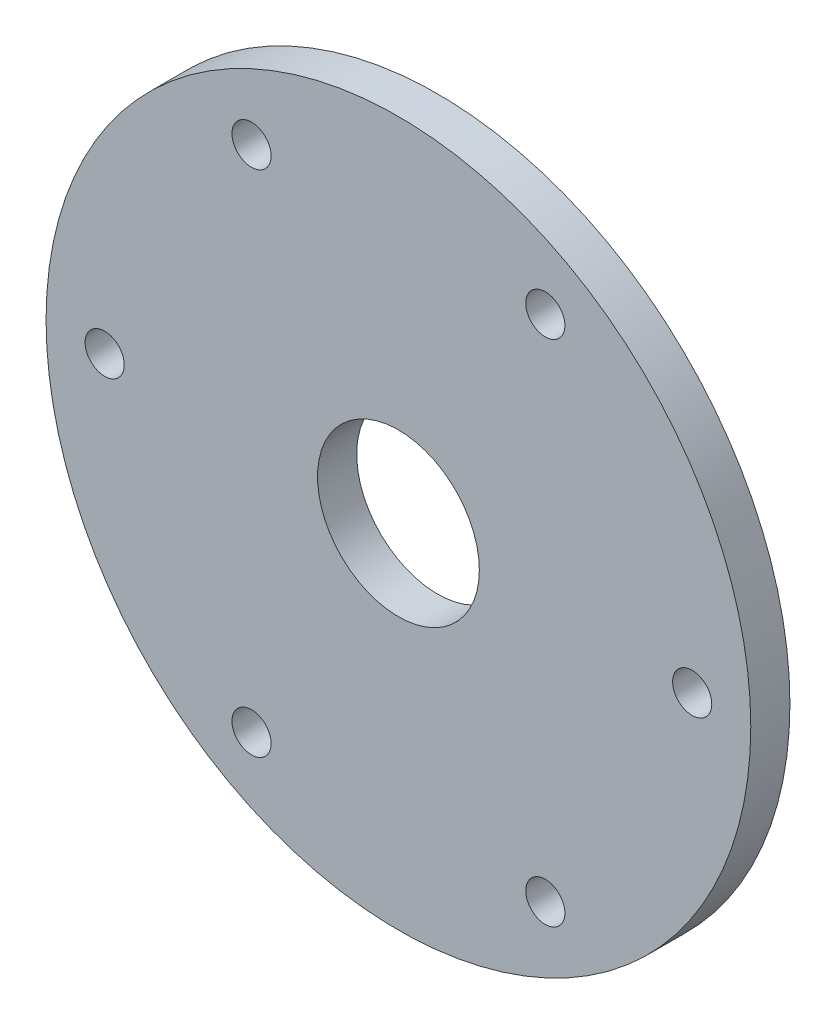
ISO-10303-21;
HEADER;
FILE_DESCRIPTION(('STEP AP214'),'2;1');
FILE_NAME('part.step','',(''),(''),'','','');
FILE_SCHEMA(('AUTOMOTIVE_DESIGN { 1 0 10303 214 1 1 1 1 }'));
ENDSEC;
DATA;
#1=APPLICATION_CONTEXT('core data for automotive mechanical design processes');
#2=APPLICATION_PROTOCOL_DEFINITION('international standard','automotive_design',2000,#1);
#3=PRODUCT_CONTEXT('',#1,'mechanical');
#4=PRODUCT('Part','Part','',(#3));
#5=PRODUCT_RELATED_PRODUCT_CATEGORY('part','',(#4));
#6=PRODUCT_DEFINITION_FORMATION('','',#4);
#7=PRODUCT_DEFINITION_CONTEXT('part definition',#1,'design');
#8=PRODUCT_DEFINITION('design','',#6,#7);
#9=PRODUCT_DEFINITION_SHAPE('','',#8);
#10=(LENGTH_UNIT() NAMED_UNIT(*) SI_UNIT(.MILLI.,.METRE.));
#11=(NAMED_UNIT(*) PLANE_ANGLE_UNIT() SI_UNIT($,.RADIAN.));
#12=(NAMED_UNIT(*) SI_UNIT($,.STERADIAN.) SOLID_ANGLE_UNIT());
#13=UNCERTAINTY_MEASURE_WITH_UNIT(LENGTH_MEASURE(1.E-05),#10,'distance_accuracy_value','');
#14=(GEOMETRIC_REPRESENTATION_CONTEXT(3) GLOBAL_UNCERTAINTY_ASSIGNED_CONTEXT((#13)) GLOBAL_UNIT_ASSIGNED_CONTEXT((#10,
#11,#12)) REPRESENTATION_CONTEXT('',''));
#15=CARTESIAN_POINT('',(0.,0.,0.));
#16=DIRECTION('',(0.,0.,1.));
#17=DIRECTION('',(1.,0.,0.));
#18=AXIS2_PLACEMENT_3D('',#15,#16,#17);
#19=CARTESIAN_POINT('',(0.,0.,3.));
#20=DIRECTION('',(0.,0.,1.));
#21=DIRECTION('',(1.,0.,0.));
#22=AXIS2_PLACEMENT_3D('',#19,#20,#21);
#23=PLANE('',#22);
#24=CARTESIAN_POINT('',(-11.2549999999998,19.4942318391878,3.));
#25=DIRECTION('',(0.,0.,1.));
#26=DIRECTION('',(1.,0.,0.));
#27=AXIS2_PLACEMENT_3D('',#24,#25,#26);
#28=CIRCLE('',#27,1.5);
#29=CARTESIAN_POINT('',(-9.75499999999982,19.4942318391878,3.));
#30=VERTEX_POINT('',#29);
#31=EDGE_CURVE('E92',#30,#30,#28,.T.);
#32=ORIENTED_EDGE('',*,*,#31,.F.);
#33=EDGE_LOOP('',(#32));
#34=FACE_BOUND('',#33,.T.);
#35=CARTESIAN_POINT('',(-11.2550000000001,-19.4942318391877,3.));
#36=DIRECTION('',(0.,0.,1.));
#37=DIRECTION('',(1.,0.,0.));
#38=AXIS2_PLACEMENT_3D('',#35,#36,#37);
#39=CIRCLE('',#38,1.5);
#40=CARTESIAN_POINT('',(-9.75500000000009,-19.4942318391877,3.));
#41=VERTEX_POINT('',#40);
#42=EDGE_CURVE('E76',#41,#41,#39,.T.);
#43=ORIENTED_EDGE('',*,*,#42,.F.);
#44=EDGE_LOOP('',(#43));
#45=FACE_BOUND('',#44,.T.);
#46=CARTESIAN_POINT('',(22.51,0.,3.));
#47=DIRECTION('',(0.,0.,1.));
#48=DIRECTION('',(1.,0.,0.));
#49=AXIS2_PLACEMENT_3D('',#46,#47,#48);
#50=CIRCLE('',#49,1.5);
#51=CARTESIAN_POINT('',(24.01,0.,3.));
#52=VERTEX_POINT('',#51);
#53=EDGE_CURVE('E60',#52,#52,#50,.T.);
#54=ORIENTED_EDGE('',*,*,#53,.F.);
#55=EDGE_LOOP('',(#54));
#56=FACE_BOUND('',#55,.T.);
#57=CARTESIAN_POINT('',(0.,0.,3.));
#58=DIRECTION('',(0.,0.,1.));
#59=DIRECTION('',(1.,0.,0.));
#60=AXIS2_PLACEMENT_3D('',#57,#58,#59);
#61=CIRCLE('',#60,27.);
#62=CARTESIAN_POINT('',(27.,0.,3.));
#63=VERTEX_POINT('',#62);
#64=EDGE_CURVE('E10',#63,#63,#61,.T.);
#65=ORIENTED_EDGE('',*,*,#64,.T.);
#66=EDGE_LOOP('',(#65));
#67=FACE_BOUND('',#66,.T.);
#68=CARTESIAN_POINT('',(0.,0.,3.));
#69=DIRECTION('',(0.,0.,1.));
#70=DIRECTION('',(1.,0.,0.));
#71=AXIS2_PLACEMENT_3D('',#68,#69,#70);
#72=CIRCLE('',#71,6.2);
#73=CARTESIAN_POINT('',(6.2,0.,3.));
#74=VERTEX_POINT('',#73);
#75=EDGE_CURVE('E54',#74,#74,#72,.T.);
#76=ORIENTED_EDGE('',*,*,#75,.F.);
#77=EDGE_LOOP('',(#76));
#78=FACE_BOUND('',#77,.T.);
#79=CARTESIAN_POINT('',(11.255,-19.4942318391877,3.));
#80=DIRECTION('',(0.,0.,1.));
#81=DIRECTION('',(1.,0.,0.));
#82=AXIS2_PLACEMENT_3D('',#79,#80,#81);
#83=CIRCLE('',#82,1.5);
#84=CARTESIAN_POINT('',(12.755,-19.4942318391877,3.));
#85=VERTEX_POINT('',#84);
#86=EDGE_CURVE('E68',#85,#85,#83,.T.);
#87=ORIENTED_EDGE('',*,*,#86,.F.);
#88=EDGE_LOOP('',(#87));
#89=FACE_BOUND('',#88,.T.);
#90=CARTESIAN_POINT('',(-22.51,1.57186489874718E-13,3.));
#91=DIRECTION('',(0.,0.,1.));
#92=DIRECTION('',(1.,0.,0.));
#93=AXIS2_PLACEMENT_3D('',#90,#91,#92);
#94=CIRCLE('',#93,1.5);
#95=CARTESIAN_POINT('',(-21.01,1.57186489874718E-13,3.));
#96=VERTEX_POINT('',#95);
#97=EDGE_CURVE('E84',#96,#96,#94,.T.);
#98=ORIENTED_EDGE('',*,*,#97,.F.);
#99=EDGE_LOOP('',(#98));
#100=FACE_BOUND('',#99,.T.);
#101=CARTESIAN_POINT('',(11.2550000000002,19.4942318391876,3.));
#102=DIRECTION('',(0.,0.,1.));
#103=DIRECTION('',(1.,0.,0.));
#104=AXIS2_PLACEMENT_3D('',#101,#102,#103);
#105=CIRCLE('',#104,1.5);
#106=CARTESIAN_POINT('',(12.7550000000002,19.4942318391876,3.));
#107=VERTEX_POINT('',#106);
#108=EDGE_CURVE('E100',#107,#107,#105,.T.);
#109=ORIENTED_EDGE('',*,*,#108,.F.);
#110=EDGE_LOOP('',(#109));
#111=FACE_BOUND('',#110,.T.);
#112=ADVANCED_FACE('F41',(#34,#45,#56,#67,#78,#89,#100,#111),#23,.T.);
#113=CARTESIAN_POINT('',(0.,0.,0.));
#114=DIRECTION('',(0.,0.,1.));
#115=DIRECTION('',(1.,0.,0.));
#116=AXIS2_PLACEMENT_3D('',#113,#114,#115);
#117=PLANE('',#116);
#118=CARTESIAN_POINT('',(0.,0.,0.));
#119=DIRECTION('',(0.,0.,1.));
#120=DIRECTION('',(1.,0.,0.));
#121=AXIS2_PLACEMENT_3D('',#118,#119,#120);
#122=CIRCLE('',#121,27.);
#123=CARTESIAN_POINT('',(27.,0.,0.));
#124=VERTEX_POINT('',#123);
#125=EDGE_CURVE('E45',#124,#124,#122,.T.);
#126=ORIENTED_EDGE('',*,*,#125,.F.);
#127=EDGE_LOOP('',(#126));
#128=FACE_BOUND('',#127,.T.);
#129=CARTESIAN_POINT('',(0.,0.,0.));
#130=DIRECTION('',(0.,0.,1.));
#131=DIRECTION('',(1.,0.,0.));
#132=AXIS2_PLACEMENT_3D('',#129,#130,#131);
#133=CIRCLE('',#132,6.2);
#134=CARTESIAN_POINT('',(6.2,0.,0.));
#135=VERTEX_POINT('',#134);
#136=EDGE_CURVE('E56',#135,#135,#133,.T.);
#137=ORIENTED_EDGE('',*,*,#136,.T.);
#138=EDGE_LOOP('',(#137));
#139=FACE_BOUND('',#138,.T.);
#140=CARTESIAN_POINT('',(22.51,0.,0.));
#141=DIRECTION('',(0.,0.,1.));
#142=DIRECTION('',(1.,0.,0.));
#143=AXIS2_PLACEMENT_3D('',#140,#141,#142);
#144=CIRCLE('',#143,1.5);
#145=CARTESIAN_POINT('',(24.01,0.,0.));
#146=VERTEX_POINT('',#145);
#147=EDGE_CURVE('E64',#146,#146,#144,.T.);
#148=ORIENTED_EDGE('',*,*,#147,.T.);
#149=EDGE_LOOP('',(#148));
#150=FACE_BOUND('',#149,.T.);
#151=CARTESIAN_POINT('',(11.255,-19.4942318391877,0.));
#152=DIRECTION('',(0.,0.,1.));
#153=DIRECTION('',(1.,0.,0.));
#154=AXIS2_PLACEMENT_3D('',#151,#152,#153);
#155=CIRCLE('',#154,1.5);
#156=CARTESIAN_POINT('',(12.755,-19.4942318391877,0.));
#157=VERTEX_POINT('',#156);
#158=EDGE_CURVE('E72',#157,#157,#155,.T.);
#159=ORIENTED_EDGE('',*,*,#158,.T.);
#160=EDGE_LOOP('',(#159));
#161=FACE_BOUND('',#160,.T.);
#162=CARTESIAN_POINT('',(-11.2550000000001,-19.4942318391877,0.));
#163=DIRECTION('',(0.,0.,1.));
#164=DIRECTION('',(1.,0.,0.));
#165=AXIS2_PLACEMENT_3D('',#162,#163,#164);
#166=CIRCLE('',#165,1.5);
#167=CARTESIAN_POINT('',(-9.75500000000009,-19.4942318391877,0.));
#168=VERTEX_POINT('',#167);
#169=EDGE_CURVE('E80',#168,#168,#166,.T.);
#170=ORIENTED_EDGE('',*,*,#169,.T.);
#171=EDGE_LOOP('',(#170));
#172=FACE_BOUND('',#171,.T.);
#173=CARTESIAN_POINT('',(-22.51,1.57186489874718E-13,0.));
#174=DIRECTION('',(0.,0.,1.));
#175=DIRECTION('',(1.,0.,0.));
#176=AXIS2_PLACEMENT_3D('',#173,#174,#175);
#177=CIRCLE('',#176,1.5);
#178=CARTESIAN_POINT('',(-21.01,1.57186489874718E-13,0.));
#179=VERTEX_POINT('',#178);
#180=EDGE_CURVE('E88',#179,#179,#177,.T.);
#181=ORIENTED_EDGE('',*,*,#180,.T.);
#182=EDGE_LOOP('',(#181));
#183=FACE_BOUND('',#182,.T.);
#184=CARTESIAN_POINT('',(-11.2549999999998,19.4942318391878,0.));
#185=DIRECTION('',(0.,0.,1.));
#186=DIRECTION('',(1.,0.,0.));
#187=AXIS2_PLACEMENT_3D('',#184,#185,#186);
#188=CIRCLE('',#187,1.5);
#189=CARTESIAN_POINT('',(-9.75499999999982,19.4942318391878,0.));
#190=VERTEX_POINT('',#189);
#191=EDGE_CURVE('E96',#190,#190,#188,.T.);
#192=ORIENTED_EDGE('',*,*,#191,.T.);
#193=EDGE_LOOP('',(#192));
#194=FACE_BOUND('',#193,.T.);
#195=CARTESIAN_POINT('',(11.2550000000002,19.4942318391876,0.));
#196=DIRECTION('',(0.,0.,1.));
#197=DIRECTION('',(1.,0.,0.));
#198=AXIS2_PLACEMENT_3D('',#195,#196,#197);
#199=CIRCLE('',#198,1.5);
#200=CARTESIAN_POINT('',(12.7550000000002,19.4942318391876,0.));
#201=VERTEX_POINT('',#200);
#202=EDGE_CURVE('E104',#201,#201,#199,.T.);
#203=ORIENTED_EDGE('',*,*,#202,.T.);
#204=EDGE_LOOP('',(#203));
#205=FACE_BOUND('',#204,.T.);
#206=ADVANCED_FACE('F116',(#128,#139,#150,#161,#172,#183,#194,#205),#117,.F.);
#207=CARTESIAN_POINT('',(0.,0.,3.));
#208=DIRECTION('',(0.,0.,-1.));
#209=DIRECTION('',(-1.,0.,0.));
#210=AXIS2_PLACEMENT_3D('',#207,#208,#209);
#211=CYLINDRICAL_SURFACE('',#210,27.);
#212=ORIENTED_EDGE('',*,*,#64,.F.);
#213=EDGE_LOOP('',(#212));
#214=FACE_BOUND('',#213,.T.);
#215=ORIENTED_EDGE('',*,*,#125,.T.);
#216=EDGE_LOOP('',(#215));
#217=FACE_BOUND('',#216,.T.);
#218=ADVANCED_FACE('F43',(#214,#217),#211,.T.);
#219=CARTESIAN_POINT('',(0.,0.,3.));
#220=DIRECTION('',(0.,0.,-1.));
#221=DIRECTION('',(-1.,0.,0.));
#222=AXIS2_PLACEMENT_3D('',#219,#220,#221);
#223=CYLINDRICAL_SURFACE('',#222,6.2);
#224=ORIENTED_EDGE('',*,*,#75,.T.);
#225=EDGE_LOOP('',(#224));
#226=FACE_BOUND('',#225,.T.);
#227=ORIENTED_EDGE('',*,*,#136,.F.);
#228=EDGE_LOOP('',(#227));
#229=FACE_BOUND('',#228,.T.);
#230=ADVANCED_FACE('F126',(#226,#229),#223,.F.);
#231=CARTESIAN_POINT('',(22.51,0.,3.));
#232=DIRECTION('',(0.,0.,-1.));
#233=DIRECTION('',(-1.,0.,0.));
#234=AXIS2_PLACEMENT_3D('',#231,#232,#233);
#235=CYLINDRICAL_SURFACE('',#234,1.5);
#236=ORIENTED_EDGE('',*,*,#53,.T.);
#237=EDGE_LOOP('',(#236));
#238=FACE_BOUND('',#237,.T.);
#239=ORIENTED_EDGE('',*,*,#147,.F.);
#240=EDGE_LOOP('',(#239));
#241=FACE_BOUND('',#240,.T.);
#242=ADVANCED_FACE('F129',(#238,#241),#235,.F.);
#243=CARTESIAN_POINT('',(11.255,-19.4942318391877,3.));
#244=DIRECTION('',(0.,0.,-1.));
#245=DIRECTION('',(-1.,0.,0.));
#246=AXIS2_PLACEMENT_3D('',#243,#244,#245);
#247=CYLINDRICAL_SURFACE('',#246,1.5);
#248=ORIENTED_EDGE('',*,*,#86,.T.);
#249=EDGE_LOOP('',(#248));
#250=FACE_BOUND('',#249,.T.);
#251=ORIENTED_EDGE('',*,*,#158,.F.);
#252=EDGE_LOOP('',(#251));
#253=FACE_BOUND('',#252,.T.);
#254=ADVANCED_FACE('F133',(#250,#253),#247,.F.);
#255=CARTESIAN_POINT('',(-11.2550000000001,-19.4942318391877,3.));
#256=DIRECTION('',(0.,0.,-1.));
#257=DIRECTION('',(-1.,0.,0.));
#258=AXIS2_PLACEMENT_3D('',#255,#256,#257);
#259=CYLINDRICAL_SURFACE('',#258,1.5);
#260=ORIENTED_EDGE('',*,*,#42,.T.);
#261=EDGE_LOOP('',(#260));
#262=FACE_BOUND('',#261,.T.);
#263=ORIENTED_EDGE('',*,*,#169,.F.);
#264=EDGE_LOOP('',(#263));
#265=FACE_BOUND('',#264,.T.);
#266=ADVANCED_FACE('F137',(#262,#265),#259,.F.);
#267=CARTESIAN_POINT('',(-22.51,1.57186489874718E-13,3.));
#268=DIRECTION('',(0.,0.,-1.));
#269=DIRECTION('',(-1.,0.,0.));
#270=AXIS2_PLACEMENT_3D('',#267,#268,#269);
#271=CYLINDRICAL_SURFACE('',#270,1.5);
#272=ORIENTED_EDGE('',*,*,#97,.T.);
#273=EDGE_LOOP('',(#272));
#274=FACE_BOUND('',#273,.T.);
#275=ORIENTED_EDGE('',*,*,#180,.F.);
#276=EDGE_LOOP('',(#275));
#277=FACE_BOUND('',#276,.T.);
#278=ADVANCED_FACE('F141',(#274,#277),#271,.F.);
#279=CARTESIAN_POINT('',(-11.2549999999998,19.4942318391878,3.));
#280=DIRECTION('',(0.,0.,-1.));
#281=DIRECTION('',(-1.,0.,0.));
#282=AXIS2_PLACEMENT_3D('',#279,#280,#281);
#283=CYLINDRICAL_SURFACE('',#282,1.5);
#284=ORIENTED_EDGE('',*,*,#31,.T.);
#285=EDGE_LOOP('',(#284));
#286=FACE_BOUND('',#285,.T.);
#287=ORIENTED_EDGE('',*,*,#191,.F.);
#288=EDGE_LOOP('',(#287));
#289=FACE_BOUND('',#288,.T.);
#290=ADVANCED_FACE('F145',(#286,#289),#283,.F.);
#291=CARTESIAN_POINT('',(11.2550000000002,19.4942318391876,3.));
#292=DIRECTION('',(0.,0.,-1.));
#293=DIRECTION('',(-1.,0.,0.));
#294=AXIS2_PLACEMENT_3D('',#291,#292,#293);
#295=CYLINDRICAL_SURFACE('',#294,1.5);
#296=ORIENTED_EDGE('',*,*,#108,.T.);
#297=EDGE_LOOP('',(#296));
#298=FACE_BOUND('',#297,.T.);
#299=ORIENTED_EDGE('',*,*,#202,.F.);
#300=EDGE_LOOP('',(#299));
#301=FACE_BOUND('',#300,.T.);
#302=ADVANCED_FACE('F112',(#298,#301),#295,.F.);
#303=CLOSED_SHELL('',(#112,#206,#218,#230,#242,#254,#266,#278,#290,#302));
#304=MANIFOLD_SOLID_BREP('B2',#303);
#305=ADVANCED_BREP_SHAPE_REPRESENTATION('',(#18,#304),#14);
#306=SHAPE_DEFINITION_REPRESENTATION(#9,#305);
ENDSEC;
END-ISO-10303-21;
